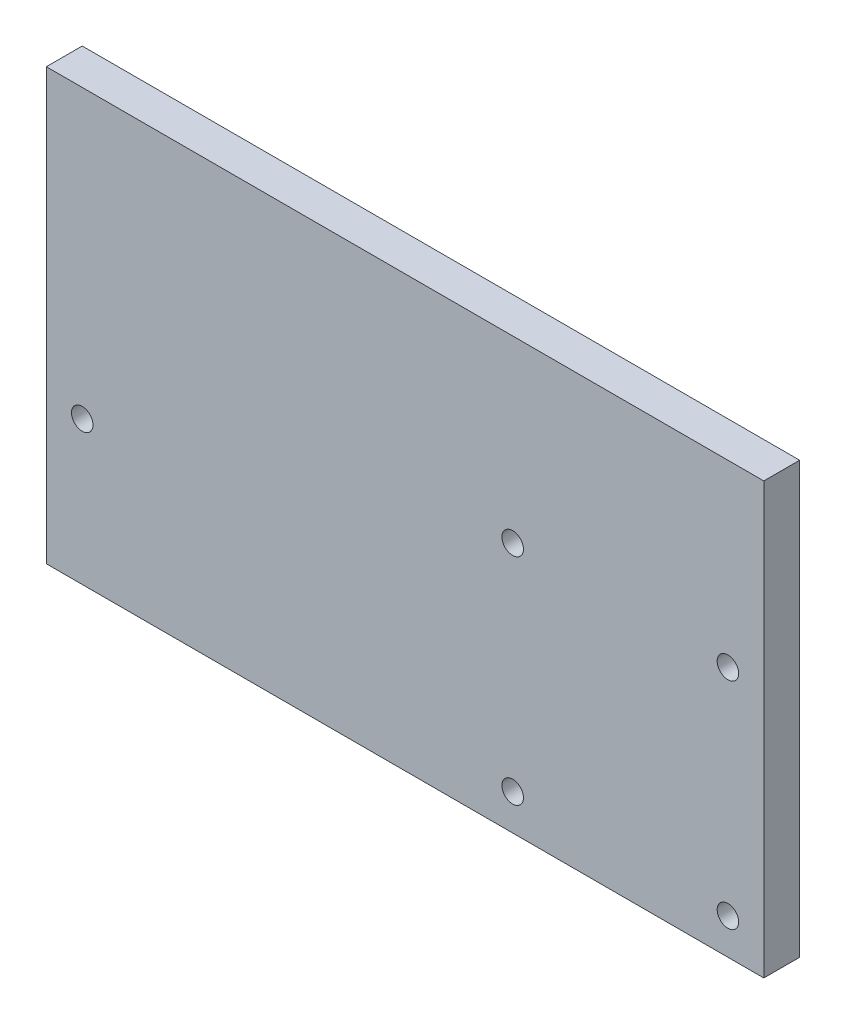
ISO-10303-21;
HEADER;
FILE_DESCRIPTION(('STEP AP214'),'2;1');
FILE_NAME('part.step','',(''),(''),'','','');
FILE_SCHEMA(('AUTOMOTIVE_DESIGN { 1 0 10303 214 1 1 1 1 }'));
ENDSEC;
DATA;
#1=APPLICATION_CONTEXT('core data for automotive mechanical design processes');
#2=APPLICATION_PROTOCOL_DEFINITION('international standard','automotive_design',2000,#1);
#3=PRODUCT_CONTEXT('',#1,'mechanical');
#4=PRODUCT('Part','Part','',(#3));
#5=PRODUCT_RELATED_PRODUCT_CATEGORY('part','',(#4));
#6=PRODUCT_DEFINITION_FORMATION('','',#4);
#7=PRODUCT_DEFINITION_CONTEXT('part definition',#1,'design');
#8=PRODUCT_DEFINITION('design','',#6,#7);
#9=PRODUCT_DEFINITION_SHAPE('','',#8);
#10=(LENGTH_UNIT() NAMED_UNIT(*) SI_UNIT(.MILLI.,.METRE.));
#11=(NAMED_UNIT(*) PLANE_ANGLE_UNIT() SI_UNIT($,.RADIAN.));
#12=(NAMED_UNIT(*) SI_UNIT($,.STERADIAN.) SOLID_ANGLE_UNIT());
#13=UNCERTAINTY_MEASURE_WITH_UNIT(LENGTH_MEASURE(1.E-05),#10,'distance_accuracy_value','');
#14=(GEOMETRIC_REPRESENTATION_CONTEXT(3) GLOBAL_UNCERTAINTY_ASSIGNED_CONTEXT((#13)) GLOBAL_UNIT_ASSIGNED_CONTEXT((#10,
#11,#12)) REPRESENTATION_CONTEXT('',''));
#15=CARTESIAN_POINT('',(0.,0.,0.));
#16=DIRECTION('',(0.,0.,1.));
#17=DIRECTION('',(1.,0.,0.));
#18=AXIS2_PLACEMENT_3D('',#15,#16,#17);
#19=CARTESIAN_POINT('',(0.,0.,6.35));
#20=DIRECTION('',(1.,0.,0.));
#21=DIRECTION('',(0.,1.,0.));
#22=AXIS2_PLACEMENT_3D('',#19,#20,#21);
#23=PLANE('',#22);
#24=DIRECTION('',(0.,-1.,0.));
#25=VECTOR('',#24,1.);
#26=CARTESIAN_POINT('',(0.,0.,0.));
#27=LINE('',#26,#25);
#28=CARTESIAN_POINT('',(0.,0.,0.));
#29=VERTEX_POINT('',#28);
#30=CARTESIAN_POINT('',(0.,-76.2,0.));
#31=VERTEX_POINT('',#30);
#32=EDGE_CURVE('E98',#29,#31,#27,.T.);
#33=ORIENTED_EDGE('',*,*,#32,.T.);
#34=DIRECTION('',(0.,0.,-1.));
#35=VECTOR('',#34,1.);
#36=CARTESIAN_POINT('',(0.,-76.2,6.35));
#37=LINE('',#36,#35);
#38=CARTESIAN_POINT('',(0.,-76.2,6.35));
#39=VERTEX_POINT('',#38);
#40=EDGE_CURVE('E11',#39,#31,#37,.T.);
#41=ORIENTED_EDGE('',*,*,#40,.F.);
#42=DIRECTION('',(0.,-1.,0.));
#43=VECTOR('',#42,1.);
#44=CARTESIAN_POINT('',(0.,0.,6.35));
#45=LINE('',#44,#43);
#46=CARTESIAN_POINT('',(0.,0.,6.35));
#47=VERTEX_POINT('',#46);
#48=EDGE_CURVE('E86',#47,#39,#45,.T.);
#49=ORIENTED_EDGE('',*,*,#48,.F.);
#50=DIRECTION('',(0.,0.,-1.));
#51=VECTOR('',#50,1.);
#52=CARTESIAN_POINT('',(0.,0.,6.35));
#53=LINE('',#52,#51);
#54=EDGE_CURVE('E94',#47,#29,#53,.T.);
#55=ORIENTED_EDGE('',*,*,#54,.T.);
#56=EDGE_LOOP('',(#33,#41,#49,#55));
#57=FACE_BOUND('',#56,.T.);
#58=ADVANCED_FACE('F35',(#57),#23,.F.);
#59=CARTESIAN_POINT('',(0.,-76.2,6.35));
#60=DIRECTION('',(0.,1.,0.));
#61=DIRECTION('',(0.,0.,1.));
#62=AXIS2_PLACEMENT_3D('',#59,#60,#61);
#63=PLANE('',#62);
#64=DIRECTION('',(1.,0.,0.));
#65=VECTOR('',#64,1.);
#66=CARTESIAN_POINT('',(0.,-76.2,0.));
#67=LINE('',#66,#65);
#68=CARTESIAN_POINT('',(127.,-76.2,0.));
#69=VERTEX_POINT('',#68);
#70=EDGE_CURVE('E90',#31,#69,#67,.T.);
#71=ORIENTED_EDGE('',*,*,#70,.T.);
#72=DIRECTION('',(0.,0.,-1.));
#73=VECTOR('',#72,1.);
#74=CARTESIAN_POINT('',(127.,-76.2,6.35));
#75=LINE('',#74,#73);
#76=CARTESIAN_POINT('',(127.,-76.2,6.35));
#77=VERTEX_POINT('',#76);
#78=EDGE_CURVE('E43',#77,#69,#75,.T.);
#79=ORIENTED_EDGE('',*,*,#78,.F.);
#80=DIRECTION('',(1.,0.,0.));
#81=VECTOR('',#80,1.);
#82=CARTESIAN_POINT('',(0.,-76.2,6.35));
#83=LINE('',#82,#81);
#84=EDGE_CURVE('E81',#39,#77,#83,.T.);
#85=ORIENTED_EDGE('',*,*,#84,.F.);
#86=ORIENTED_EDGE('',*,*,#40,.T.);
#87=EDGE_LOOP('',(#71,#79,#85,#86));
#88=FACE_BOUND('',#87,.T.);
#89=ADVANCED_FACE('F89',(#88),#63,.F.);
#90=CARTESIAN_POINT('',(127.,0.,6.35));
#91=DIRECTION('',(-1.,0.,0.));
#92=DIRECTION('',(0.,0.,1.));
#93=AXIS2_PLACEMENT_3D('',#90,#91,#92);
#94=PLANE('',#93);
#95=DIRECTION('',(0.,1.,0.));
#96=VECTOR('',#95,1.);
#97=CARTESIAN_POINT('',(127.,0.,0.));
#98=LINE('',#97,#96);
#99=CARTESIAN_POINT('',(127.,0.,0.));
#100=VERTEX_POINT('',#99);
#101=EDGE_CURVE('E68',#69,#100,#98,.T.);
#102=ORIENTED_EDGE('',*,*,#101,.T.);
#103=DIRECTION('',(0.,0.,-1.));
#104=VECTOR('',#103,1.);
#105=CARTESIAN_POINT('',(127.,0.,6.35));
#106=LINE('',#105,#104);
#107=CARTESIAN_POINT('',(127.,0.,6.35));
#108=VERTEX_POINT('',#107);
#109=EDGE_CURVE('E91',#108,#100,#106,.T.);
#110=ORIENTED_EDGE('',*,*,#109,.F.);
#111=DIRECTION('',(0.,1.,0.));
#112=VECTOR('',#111,1.);
#113=CARTESIAN_POINT('',(127.,0.,6.35));
#114=LINE('',#113,#112);
#115=EDGE_CURVE('E84',#77,#108,#114,.T.);
#116=ORIENTED_EDGE('',*,*,#115,.F.);
#117=ORIENTED_EDGE('',*,*,#78,.T.);
#118=EDGE_LOOP('',(#102,#110,#116,#117));
#119=FACE_BOUND('',#118,.T.);
#120=ADVANCED_FACE('F92',(#119),#94,.F.);
#121=CARTESIAN_POINT('',(0.,0.,6.35));
#122=DIRECTION('',(0.,-1.,0.));
#123=DIRECTION('',(0.,0.,-1.));
#124=AXIS2_PLACEMENT_3D('',#121,#122,#123);
#125=PLANE('',#124);
#126=DIRECTION('',(-1.,0.,0.));
#127=VECTOR('',#126,1.);
#128=CARTESIAN_POINT('',(0.,0.,0.));
#129=LINE('',#128,#127);
#130=EDGE_CURVE('E74',#100,#29,#129,.T.);
#131=ORIENTED_EDGE('',*,*,#130,.T.);
#132=ORIENTED_EDGE('',*,*,#54,.F.);
#133=DIRECTION('',(-1.,0.,0.));
#134=VECTOR('',#133,1.);
#135=CARTESIAN_POINT('',(0.,0.,6.35));
#136=LINE('',#135,#134);
#137=EDGE_CURVE('E51',#108,#47,#136,.T.);
#138=ORIENTED_EDGE('',*,*,#137,.F.);
#139=ORIENTED_EDGE('',*,*,#109,.T.);
#140=EDGE_LOOP('',(#131,#132,#138,#139));
#141=FACE_BOUND('',#140,.T.);
#142=ADVANCED_FACE('F106',(#141),#125,.F.);
#143=CARTESIAN_POINT('',(0.,0.,6.35));
#144=DIRECTION('',(0.,0.,1.));
#145=DIRECTION('',(1.,0.,0.));
#146=AXIS2_PLACEMENT_3D('',#143,#144,#145);
#147=PLANE('',#146);
#148=CARTESIAN_POINT('',(6.35,-50.8,6.35));
#149=DIRECTION('',(0.,0.,1.));
#150=DIRECTION('',(1.,0.,0.));
#151=AXIS2_PLACEMENT_3D('',#148,#149,#150);
#152=CIRCLE('',#151,1.905);
#153=CARTESIAN_POINT('',(8.255,-50.8,6.35));
#154=VERTEX_POINT('',#153);
#155=EDGE_CURVE('E138',#154,#154,#152,.T.);
#156=ORIENTED_EDGE('',*,*,#155,.F.);
#157=EDGE_LOOP('',(#156));
#158=FACE_BOUND('',#157,.T.);
#159=CARTESIAN_POINT('',(120.65,-69.85,6.35));
#160=DIRECTION('',(0.,0.,1.));
#161=DIRECTION('',(1.,0.,0.));
#162=AXIS2_PLACEMENT_3D('',#159,#160,#161);
#163=CIRCLE('',#162,1.90500000000001);
#164=CARTESIAN_POINT('',(122.555,-69.85,6.35));
#165=VERTEX_POINT('',#164);
#166=EDGE_CURVE('E132',#165,#165,#163,.T.);
#167=ORIENTED_EDGE('',*,*,#166,.F.);
#168=EDGE_LOOP('',(#167));
#169=FACE_BOUND('',#168,.T.);
#170=CARTESIAN_POINT('',(82.55,-69.85,6.35));
#171=DIRECTION('',(0.,0.,1.));
#172=DIRECTION('',(1.,0.,0.));
#173=AXIS2_PLACEMENT_3D('',#170,#171,#172);
#174=CIRCLE('',#173,1.90500000000001);
#175=CARTESIAN_POINT('',(84.455,-69.85,6.35));
#176=VERTEX_POINT('',#175);
#177=EDGE_CURVE('E126',#176,#176,#174,.T.);
#178=ORIENTED_EDGE('',*,*,#177,.F.);
#179=EDGE_LOOP('',(#178));
#180=FACE_BOUND('',#179,.T.);
#181=CARTESIAN_POINT('',(120.65,-31.75,6.35));
#182=DIRECTION('',(0.,0.,1.));
#183=DIRECTION('',(1.,0.,0.));
#184=AXIS2_PLACEMENT_3D('',#181,#182,#183);
#185=CIRCLE('',#184,1.90500000000001);
#186=CARTESIAN_POINT('',(122.555,-31.75,6.35));
#187=VERTEX_POINT('',#186);
#188=EDGE_CURVE('E120',#187,#187,#185,.T.);
#189=ORIENTED_EDGE('',*,*,#188,.F.);
#190=EDGE_LOOP('',(#189));
#191=FACE_BOUND('',#190,.T.);
#192=CARTESIAN_POINT('',(82.55,-31.75,6.35));
#193=DIRECTION('',(0.,0.,1.));
#194=DIRECTION('',(1.,0.,0.));
#195=AXIS2_PLACEMENT_3D('',#192,#193,#194);
#196=CIRCLE('',#195,1.90500000000001);
#197=CARTESIAN_POINT('',(84.455,-31.75,6.35));
#198=VERTEX_POINT('',#197);
#199=EDGE_CURVE('E114',#198,#198,#196,.T.);
#200=ORIENTED_EDGE('',*,*,#199,.F.);
#201=EDGE_LOOP('',(#200));
#202=FACE_BOUND('',#201,.T.);
#203=ORIENTED_EDGE('',*,*,#48,.T.);
#204=ORIENTED_EDGE('',*,*,#84,.T.);
#205=ORIENTED_EDGE('',*,*,#115,.T.);
#206=ORIENTED_EDGE('',*,*,#137,.T.);
#207=EDGE_LOOP('',(#203,#204,#205,#206));
#208=FACE_BOUND('',#207,.T.);
#209=ADVANCED_FACE('F82',(#158,#169,#180,#191,#202,#208),#147,.T.);
#210=CARTESIAN_POINT('',(0.,0.,0.));
#211=DIRECTION('',(0.,0.,1.));
#212=DIRECTION('',(1.,0.,0.));
#213=AXIS2_PLACEMENT_3D('',#210,#211,#212);
#214=PLANE('',#213);
#215=CARTESIAN_POINT('',(6.35,-50.8,0.));
#216=DIRECTION('',(0.,0.,1.));
#217=DIRECTION('',(1.,0.,0.));
#218=AXIS2_PLACEMENT_3D('',#215,#216,#217);
#219=CIRCLE('',#218,1.905);
#220=CARTESIAN_POINT('',(8.255,-50.8,0.));
#221=VERTEX_POINT('',#220);
#222=EDGE_CURVE('E135',#221,#221,#219,.F.);
#223=ORIENTED_EDGE('',*,*,#222,.F.);
#224=EDGE_LOOP('',(#223));
#225=FACE_BOUND('',#224,.T.);
#226=CARTESIAN_POINT('',(120.65,-69.85,0.));
#227=DIRECTION('',(0.,0.,1.));
#228=DIRECTION('',(1.,0.,0.));
#229=AXIS2_PLACEMENT_3D('',#226,#227,#228);
#230=CIRCLE('',#229,1.90500000000001);
#231=CARTESIAN_POINT('',(122.555,-69.85,0.));
#232=VERTEX_POINT('',#231);
#233=EDGE_CURVE('E129',#232,#232,#230,.F.);
#234=ORIENTED_EDGE('',*,*,#233,.F.);
#235=EDGE_LOOP('',(#234));
#236=FACE_BOUND('',#235,.T.);
#237=CARTESIAN_POINT('',(82.55,-69.85,0.));
#238=DIRECTION('',(0.,0.,1.));
#239=DIRECTION('',(1.,0.,0.));
#240=AXIS2_PLACEMENT_3D('',#237,#238,#239);
#241=CIRCLE('',#240,1.90500000000001);
#242=CARTESIAN_POINT('',(84.455,-69.85,0.));
#243=VERTEX_POINT('',#242);
#244=EDGE_CURVE('E123',#243,#243,#241,.F.);
#245=ORIENTED_EDGE('',*,*,#244,.F.);
#246=EDGE_LOOP('',(#245));
#247=FACE_BOUND('',#246,.T.);
#248=CARTESIAN_POINT('',(120.65,-31.75,0.));
#249=DIRECTION('',(0.,0.,1.));
#250=DIRECTION('',(1.,0.,0.));
#251=AXIS2_PLACEMENT_3D('',#248,#249,#250);
#252=CIRCLE('',#251,1.90500000000001);
#253=CARTESIAN_POINT('',(122.555,-31.75,0.));
#254=VERTEX_POINT('',#253);
#255=EDGE_CURVE('E117',#254,#254,#252,.F.);
#256=ORIENTED_EDGE('',*,*,#255,.F.);
#257=EDGE_LOOP('',(#256));
#258=FACE_BOUND('',#257,.T.);
#259=CARTESIAN_POINT('',(82.55,-31.75,0.));
#260=DIRECTION('',(0.,0.,1.));
#261=DIRECTION('',(1.,0.,0.));
#262=AXIS2_PLACEMENT_3D('',#259,#260,#261);
#263=CIRCLE('',#262,1.90500000000001);
#264=CARTESIAN_POINT('',(84.455,-31.75,0.));
#265=VERTEX_POINT('',#264);
#266=EDGE_CURVE('E101',#265,#265,#263,.F.);
#267=ORIENTED_EDGE('',*,*,#266,.F.);
#268=EDGE_LOOP('',(#267));
#269=FACE_BOUND('',#268,.T.);
#270=ORIENTED_EDGE('',*,*,#32,.F.);
#271=ORIENTED_EDGE('',*,*,#130,.F.);
#272=ORIENTED_EDGE('',*,*,#101,.F.);
#273=ORIENTED_EDGE('',*,*,#70,.F.);
#274=EDGE_LOOP('',(#270,#271,#272,#273));
#275=FACE_BOUND('',#274,.T.);
#276=ADVANCED_FACE('F109',(#225,#236,#247,#258,#269,#275),#214,.F.);
#277=CARTESIAN_POINT('',(82.55,-31.75,-0.00100000000000013));
#278=DIRECTION('',(0.,0.,1.));
#279=DIRECTION('',(1.,0.,0.));
#280=AXIS2_PLACEMENT_3D('',#277,#278,#279);
#281=CYLINDRICAL_SURFACE('',#280,1.90500000000001);
#282=ORIENTED_EDGE('',*,*,#199,.T.);
#283=EDGE_LOOP('',(#282));
#284=FACE_BOUND('',#283,.T.);
#285=ORIENTED_EDGE('',*,*,#266,.T.);
#286=EDGE_LOOP('',(#285));
#287=FACE_BOUND('',#286,.T.);
#288=ADVANCED_FACE('F156',(#284,#287),#281,.F.);
#289=CARTESIAN_POINT('',(120.65,-31.75,-0.00100000000000013));
#290=DIRECTION('',(0.,0.,1.));
#291=DIRECTION('',(1.,0.,0.));
#292=AXIS2_PLACEMENT_3D('',#289,#290,#291);
#293=CYLINDRICAL_SURFACE('',#292,1.90500000000001);
#294=ORIENTED_EDGE('',*,*,#188,.T.);
#295=EDGE_LOOP('',(#294));
#296=FACE_BOUND('',#295,.T.);
#297=ORIENTED_EDGE('',*,*,#255,.T.);
#298=EDGE_LOOP('',(#297));
#299=FACE_BOUND('',#298,.T.);
#300=ADVANCED_FACE('F159',(#296,#299),#293,.F.);
#301=CARTESIAN_POINT('',(82.55,-69.85,-0.00100000000000013));
#302=DIRECTION('',(0.,0.,1.));
#303=DIRECTION('',(1.,0.,0.));
#304=AXIS2_PLACEMENT_3D('',#301,#302,#303);
#305=CYLINDRICAL_SURFACE('',#304,1.90500000000001);
#306=ORIENTED_EDGE('',*,*,#177,.T.);
#307=EDGE_LOOP('',(#306));
#308=FACE_BOUND('',#307,.T.);
#309=ORIENTED_EDGE('',*,*,#244,.T.);
#310=EDGE_LOOP('',(#309));
#311=FACE_BOUND('',#310,.T.);
#312=ADVANCED_FACE('F207',(#308,#311),#305,.F.);
#313=CARTESIAN_POINT('',(120.65,-69.85,-0.00100000000000013));
#314=DIRECTION('',(0.,0.,1.));
#315=DIRECTION('',(1.,0.,0.));
#316=AXIS2_PLACEMENT_3D('',#313,#314,#315);
#317=CYLINDRICAL_SURFACE('',#316,1.90500000000001);
#318=ORIENTED_EDGE('',*,*,#166,.T.);
#319=EDGE_LOOP('',(#318));
#320=FACE_BOUND('',#319,.T.);
#321=ORIENTED_EDGE('',*,*,#233,.T.);
#322=EDGE_LOOP('',(#321));
#323=FACE_BOUND('',#322,.T.);
#324=ADVANCED_FACE('F217',(#320,#323),#317,.F.);
#325=CARTESIAN_POINT('',(6.35,-50.8,-0.00100000000000013));
#326=DIRECTION('',(0.,0.,1.));
#327=DIRECTION('',(1.,0.,0.));
#328=AXIS2_PLACEMENT_3D('',#325,#326,#327);
#329=CYLINDRICAL_SURFACE('',#328,1.905);
#330=ORIENTED_EDGE('',*,*,#155,.T.);
#331=EDGE_LOOP('',(#330));
#332=FACE_BOUND('',#331,.T.);
#333=ORIENTED_EDGE('',*,*,#222,.T.);
#334=EDGE_LOOP('',(#333));
#335=FACE_BOUND('',#334,.T.);
#336=ADVANCED_FACE('F142',(#332,#335),#329,.F.);
#337=CLOSED_SHELL('',(#58,#89,#120,#142,#209,#276,#288,#300,#312,#324,#336));
#338=MANIFOLD_SOLID_BREP('B2',#337);
#339=ADVANCED_BREP_SHAPE_REPRESENTATION('',(#18,#338),#14);
#340=SHAPE_DEFINITION_REPRESENTATION(#9,#339);
ENDSEC;
END-ISO-10303-21;
